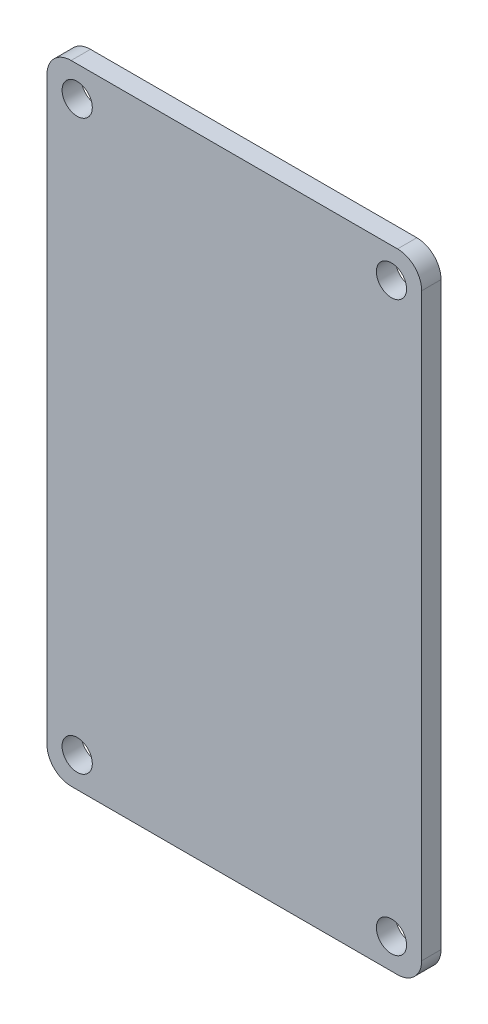
ISO-10303-21;
HEADER;
FILE_DESCRIPTION(('STEP AP214'),'2;1');
FILE_NAME('part.step','',(''),(''),'','','');
FILE_SCHEMA(('AUTOMOTIVE_DESIGN { 1 0 10303 214 1 1 1 1 }'));
ENDSEC;
DATA;
#1=APPLICATION_CONTEXT('core data for automotive mechanical design processes');
#2=APPLICATION_PROTOCOL_DEFINITION('international standard','automotive_design',2000,#1);
#3=PRODUCT_CONTEXT('',#1,'mechanical');
#4=PRODUCT('Part','Part','',(#3));
#5=PRODUCT_RELATED_PRODUCT_CATEGORY('part','',(#4));
#6=PRODUCT_DEFINITION_FORMATION('','',#4);
#7=PRODUCT_DEFINITION_CONTEXT('part definition',#1,'design');
#8=PRODUCT_DEFINITION('design','',#6,#7);
#9=PRODUCT_DEFINITION_SHAPE('','',#8);
#10=(LENGTH_UNIT() NAMED_UNIT(*) SI_UNIT(.MILLI.,.METRE.));
#11=(NAMED_UNIT(*) PLANE_ANGLE_UNIT() SI_UNIT($,.RADIAN.));
#12=(NAMED_UNIT(*) SI_UNIT($,.STERADIAN.) SOLID_ANGLE_UNIT());
#13=UNCERTAINTY_MEASURE_WITH_UNIT(LENGTH_MEASURE(1.E-05),#10,'distance_accuracy_value','');
#14=(GEOMETRIC_REPRESENTATION_CONTEXT(3) GLOBAL_UNCERTAINTY_ASSIGNED_CONTEXT((#13)) GLOBAL_UNIT_ASSIGNED_CONTEXT((#10,
#11,#12)) REPRESENTATION_CONTEXT('',''));
#15=CARTESIAN_POINT('',(0.,0.,0.));
#16=DIRECTION('',(0.,0.,1.));
#17=DIRECTION('',(1.,0.,0.));
#18=AXIS2_PLACEMENT_3D('',#15,#16,#17);
#19=CARTESIAN_POINT('',(13.5,-24.,1.6));
#20=DIRECTION('',(0.,0.,1.));
#21=DIRECTION('',(1.,0.,0.));
#22=AXIS2_PLACEMENT_3D('',#19,#20,#21);
#23=PLANE('',#22);
#24=CARTESIAN_POINT('',(13.,-23.5,1.6));
#25=DIRECTION('',(0.,0.,1.));
#26=DIRECTION('',(1.,0.,0.));
#27=AXIS2_PLACEMENT_3D('',#24,#25,#26);
#28=CIRCLE('',#27,1.25);
#29=CARTESIAN_POINT('',(14.25,-23.5,1.6));
#30=VERTEX_POINT('',#29);
#31=EDGE_CURVE('E231',#30,#30,#28,.T.);
#32=ORIENTED_EDGE('',*,*,#31,.F.);
#33=EDGE_LOOP('',(#32));
#34=FACE_BOUND('',#33,.T.);
#35=CARTESIAN_POINT('',(-13.,23.5,1.6));
#36=DIRECTION('',(0.,0.,1.));
#37=DIRECTION('',(1.,0.,0.));
#38=AXIS2_PLACEMENT_3D('',#35,#36,#37);
#39=CIRCLE('',#38,1.25);
#40=CARTESIAN_POINT('',(-11.75,23.5,1.6));
#41=VERTEX_POINT('',#40);
#42=EDGE_CURVE('E158',#41,#41,#39,.T.);
#43=ORIENTED_EDGE('',*,*,#42,.F.);
#44=EDGE_LOOP('',(#43));
#45=FACE_BOUND('',#44,.T.);
#46=CARTESIAN_POINT('',(13.5,-24.,1.6));
#47=DIRECTION('',(0.,0.,1.));
#48=DIRECTION('',(1.,0.,0.));
#49=AXIS2_PLACEMENT_3D('',#46,#47,#48);
#50=CIRCLE('',#49,2.);
#51=CARTESIAN_POINT('',(13.5,-26.,1.6));
#52=VERTEX_POINT('',#51);
#53=CARTESIAN_POINT('',(15.5,-24.,1.6));
#54=VERTEX_POINT('',#53);
#55=EDGE_CURVE('E176',#52,#54,#50,.T.);
#56=ORIENTED_EDGE('',*,*,#55,.T.);
#57=DIRECTION('',(0.,1.,0.));
#58=VECTOR('',#57,1.);
#59=CARTESIAN_POINT('',(15.5,24.,1.6));
#60=LINE('',#59,#58);
#61=CARTESIAN_POINT('',(15.5,24.,1.6));
#62=VERTEX_POINT('',#61);
#63=EDGE_CURVE('E107',#54,#62,#60,.T.);
#64=ORIENTED_EDGE('',*,*,#63,.T.);
#65=CARTESIAN_POINT('',(13.5,24.,1.6));
#66=DIRECTION('',(0.,0.,1.));
#67=DIRECTION('',(-1.,0.,0.));
#68=AXIS2_PLACEMENT_3D('',#65,#66,#67);
#69=CIRCLE('',#68,2.);
#70=CARTESIAN_POINT('',(13.5,26.,1.6));
#71=VERTEX_POINT('',#70);
#72=EDGE_CURVE('E196',#62,#71,#69,.T.);
#73=ORIENTED_EDGE('',*,*,#72,.T.);
#74=DIRECTION('',(-1.,0.,0.));
#75=VECTOR('',#74,1.);
#76=CARTESIAN_POINT('',(-13.5,26.,1.6));
#77=LINE('',#76,#75);
#78=CARTESIAN_POINT('',(-13.5,26.,1.6));
#79=VERTEX_POINT('',#78);
#80=EDGE_CURVE('E210',#71,#79,#77,.T.);
#81=ORIENTED_EDGE('',*,*,#80,.T.);
#82=CARTESIAN_POINT('',(-13.5,24.,1.6));
#83=DIRECTION('',(0.,0.,1.));
#84=DIRECTION('',(1.,0.,0.));
#85=AXIS2_PLACEMENT_3D('',#82,#83,#84);
#86=CIRCLE('',#85,2.);
#87=CARTESIAN_POINT('',(-15.5,24.,1.6));
#88=VERTEX_POINT('',#87);
#89=EDGE_CURVE('E131',#79,#88,#86,.T.);
#90=ORIENTED_EDGE('',*,*,#89,.T.);
#91=DIRECTION('',(0.,-1.,0.));
#92=VECTOR('',#91,1.);
#93=CARTESIAN_POINT('',(-15.5,24.,1.6));
#94=LINE('',#93,#92);
#95=CARTESIAN_POINT('',(-15.5,-24.,1.6));
#96=VERTEX_POINT('',#95);
#97=EDGE_CURVE('E125',#88,#96,#94,.T.);
#98=ORIENTED_EDGE('',*,*,#97,.T.);
#99=CARTESIAN_POINT('',(-13.5,-24.,1.6));
#100=DIRECTION('',(0.,0.,1.));
#101=DIRECTION('',(1.,0.,0.));
#102=AXIS2_PLACEMENT_3D('',#99,#100,#101);
#103=CIRCLE('',#102,2.);
#104=CARTESIAN_POINT('',(-13.5,-26.,1.6));
#105=VERTEX_POINT('',#104);
#106=EDGE_CURVE('E129',#96,#105,#103,.T.);
#107=ORIENTED_EDGE('',*,*,#106,.T.);
#108=DIRECTION('',(1.,0.,0.));
#109=VECTOR('',#108,1.);
#110=CARTESIAN_POINT('',(-13.5,-26.,1.6));
#111=LINE('',#110,#109);
#112=EDGE_CURVE('E57',#105,#52,#111,.T.);
#113=ORIENTED_EDGE('',*,*,#112,.T.);
#114=EDGE_LOOP('',(#56,#64,#73,#81,#90,#98,#107,#113));
#115=FACE_BOUND('',#114,.T.);
#116=CARTESIAN_POINT('',(13.,23.5,1.6));
#117=DIRECTION('',(0.,0.,1.));
#118=DIRECTION('',(-1.,0.,0.));
#119=AXIS2_PLACEMENT_3D('',#116,#117,#118);
#120=CIRCLE('',#119,1.25);
#121=CARTESIAN_POINT('',(11.75,23.5,1.6));
#122=VERTEX_POINT('',#121);
#123=EDGE_CURVE('E223',#122,#122,#120,.T.);
#124=ORIENTED_EDGE('',*,*,#123,.F.);
#125=EDGE_LOOP('',(#124));
#126=FACE_BOUND('',#125,.T.);
#127=CARTESIAN_POINT('',(-13.,-23.5,1.6));
#128=DIRECTION('',(0.,0.,1.));
#129=DIRECTION('',(-1.,0.,0.));
#130=AXIS2_PLACEMENT_3D('',#127,#128,#129);
#131=CIRCLE('',#130,1.25);
#132=CARTESIAN_POINT('',(-14.25,-23.5,1.6));
#133=VERTEX_POINT('',#132);
#134=EDGE_CURVE('E239',#133,#133,#131,.T.);
#135=ORIENTED_EDGE('',*,*,#134,.F.);
#136=EDGE_LOOP('',(#135));
#137=FACE_BOUND('',#136,.T.);
#138=ADVANCED_FACE('F40',(#34,#45,#115,#126,#137),#23,.T.);
#139=CARTESIAN_POINT('',(13.5,-24.,0.));
#140=DIRECTION('',(0.,0.,1.));
#141=DIRECTION('',(1.,0.,0.));
#142=AXIS2_PLACEMENT_3D('',#139,#140,#141);
#143=PLANE('',#142);
#144=CARTESIAN_POINT('',(13.5,-24.,0.));
#145=DIRECTION('',(0.,0.,1.));
#146=DIRECTION('',(1.,0.,0.));
#147=AXIS2_PLACEMENT_3D('',#144,#145,#146);
#148=CIRCLE('',#147,2.);
#149=CARTESIAN_POINT('',(13.5,-26.,0.));
#150=VERTEX_POINT('',#149);
#151=CARTESIAN_POINT('',(15.5,-24.,0.));
#152=VERTEX_POINT('',#151);
#153=EDGE_CURVE('E154',#150,#152,#148,.T.);
#154=ORIENTED_EDGE('',*,*,#153,.F.);
#155=DIRECTION('',(1.,0.,0.));
#156=VECTOR('',#155,1.);
#157=CARTESIAN_POINT('',(-13.5,-26.,0.));
#158=LINE('',#157,#156);
#159=CARTESIAN_POINT('',(-13.5,-26.,0.));
#160=VERTEX_POINT('',#159);
#161=EDGE_CURVE('E99',#160,#150,#158,.T.);
#162=ORIENTED_EDGE('',*,*,#161,.F.);
#163=CARTESIAN_POINT('',(-13.5,-24.,0.));
#164=DIRECTION('',(0.,0.,1.));
#165=DIRECTION('',(1.,0.,0.));
#166=AXIS2_PLACEMENT_3D('',#163,#164,#165);
#167=CIRCLE('',#166,2.);
#168=CARTESIAN_POINT('',(-15.5,-24.,0.));
#169=VERTEX_POINT('',#168);
#170=EDGE_CURVE('E93',#169,#160,#167,.T.);
#171=ORIENTED_EDGE('',*,*,#170,.F.);
#172=DIRECTION('',(0.,-1.,0.));
#173=VECTOR('',#172,1.);
#174=CARTESIAN_POINT('',(-15.5,24.,0.));
#175=LINE('',#174,#173);
#176=CARTESIAN_POINT('',(-15.5,24.,0.));
#177=VERTEX_POINT('',#176);
#178=EDGE_CURVE('E140',#177,#169,#175,.T.);
#179=ORIENTED_EDGE('',*,*,#178,.F.);
#180=CARTESIAN_POINT('',(-13.5,24.,0.));
#181=DIRECTION('',(0.,0.,1.));
#182=DIRECTION('',(1.,0.,0.));
#183=AXIS2_PLACEMENT_3D('',#180,#181,#182);
#184=CIRCLE('',#183,2.);
#185=CARTESIAN_POINT('',(-13.5,26.,0.));
#186=VERTEX_POINT('',#185);
#187=EDGE_CURVE('E167',#186,#177,#184,.T.);
#188=ORIENTED_EDGE('',*,*,#187,.F.);
#189=DIRECTION('',(-1.,0.,0.));
#190=VECTOR('',#189,1.);
#191=CARTESIAN_POINT('',(-13.5,26.,0.));
#192=LINE('',#191,#190);
#193=CARTESIAN_POINT('',(13.5,26.,0.));
#194=VERTEX_POINT('',#193);
#195=EDGE_CURVE('E164',#194,#186,#192,.T.);
#196=ORIENTED_EDGE('',*,*,#195,.F.);
#197=CARTESIAN_POINT('',(13.5,24.,0.));
#198=DIRECTION('',(0.,0.,1.));
#199=DIRECTION('',(-1.,0.,0.));
#200=AXIS2_PLACEMENT_3D('',#197,#198,#199);
#201=CIRCLE('',#200,2.);
#202=CARTESIAN_POINT('',(15.5,24.,0.));
#203=VERTEX_POINT('',#202);
#204=EDGE_CURVE('E161',#203,#194,#201,.T.);
#205=ORIENTED_EDGE('',*,*,#204,.F.);
#206=DIRECTION('',(0.,1.,0.));
#207=VECTOR('',#206,1.);
#208=CARTESIAN_POINT('',(15.5,24.,0.));
#209=LINE('',#208,#207);
#210=EDGE_CURVE('E157',#152,#203,#209,.T.);
#211=ORIENTED_EDGE('',*,*,#210,.F.);
#212=EDGE_LOOP('',(#154,#162,#171,#179,#188,#196,#205,#211));
#213=FACE_BOUND('',#212,.T.);
#214=CARTESIAN_POINT('',(-13.,23.5,0.));
#215=DIRECTION('',(0.,0.,1.));
#216=DIRECTION('',(1.,0.,0.));
#217=AXIS2_PLACEMENT_3D('',#214,#215,#216);
#218=CIRCLE('',#217,1.25);
#219=CARTESIAN_POINT('',(-11.75,23.5,0.));
#220=VERTEX_POINT('',#219);
#221=EDGE_CURVE('E220',#220,#220,#218,.T.);
#222=ORIENTED_EDGE('',*,*,#221,.T.);
#223=EDGE_LOOP('',(#222));
#224=FACE_BOUND('',#223,.T.);
#225=CARTESIAN_POINT('',(13.,23.5,0.));
#226=DIRECTION('',(0.,0.,1.));
#227=DIRECTION('',(-1.,0.,0.));
#228=AXIS2_PLACEMENT_3D('',#225,#226,#227);
#229=CIRCLE('',#228,1.25);
#230=CARTESIAN_POINT('',(11.75,23.5,0.));
#231=VERTEX_POINT('',#230);
#232=EDGE_CURVE('E227',#231,#231,#229,.T.);
#233=ORIENTED_EDGE('',*,*,#232,.T.);
#234=EDGE_LOOP('',(#233));
#235=FACE_BOUND('',#234,.T.);
#236=CARTESIAN_POINT('',(13.,-23.5,0.));
#237=DIRECTION('',(0.,0.,1.));
#238=DIRECTION('',(1.,0.,0.));
#239=AXIS2_PLACEMENT_3D('',#236,#237,#238);
#240=CIRCLE('',#239,1.25);
#241=CARTESIAN_POINT('',(14.25,-23.5,0.));
#242=VERTEX_POINT('',#241);
#243=EDGE_CURVE('E235',#242,#242,#240,.T.);
#244=ORIENTED_EDGE('',*,*,#243,.T.);
#245=EDGE_LOOP('',(#244));
#246=FACE_BOUND('',#245,.T.);
#247=CARTESIAN_POINT('',(-13.,-23.5,0.));
#248=DIRECTION('',(0.,0.,1.));
#249=DIRECTION('',(-1.,0.,0.));
#250=AXIS2_PLACEMENT_3D('',#247,#248,#249);
#251=CIRCLE('',#250,1.25);
#252=CARTESIAN_POINT('',(-14.25,-23.5,0.));
#253=VERTEX_POINT('',#252);
#254=EDGE_CURVE('E243',#253,#253,#251,.T.);
#255=ORIENTED_EDGE('',*,*,#254,.T.);
#256=EDGE_LOOP('',(#255));
#257=FACE_BOUND('',#256,.T.);
#258=ADVANCED_FACE('F200',(#213,#224,#235,#246,#257),#143,.F.);
#259=CARTESIAN_POINT('',(13.5,-24.,1.6));
#260=DIRECTION('',(0.,0.,-1.));
#261=DIRECTION('',(-1.,0.,0.));
#262=AXIS2_PLACEMENT_3D('',#259,#260,#261);
#263=CYLINDRICAL_SURFACE('',#262,2.);
#264=ORIENTED_EDGE('',*,*,#153,.T.);
#265=DIRECTION('',(0.,0.,-1.));
#266=VECTOR('',#265,1.);
#267=CARTESIAN_POINT('',(15.5,-24.,1.6));
#268=LINE('',#267,#266);
#269=EDGE_CURVE('E11',#54,#152,#268,.T.);
#270=ORIENTED_EDGE('',*,*,#269,.F.);
#271=ORIENTED_EDGE('',*,*,#55,.F.);
#272=DIRECTION('',(0.,0.,-1.));
#273=VECTOR('',#272,1.);
#274=CARTESIAN_POINT('',(13.5,-26.,1.6));
#275=LINE('',#274,#273);
#276=EDGE_CURVE('E150',#52,#150,#275,.T.);
#277=ORIENTED_EDGE('',*,*,#276,.T.);
#278=EDGE_LOOP('',(#264,#270,#271,#277));
#279=FACE_BOUND('',#278,.T.);
#280=ADVANCED_FACE('F42',(#279),#263,.T.);
#281=CARTESIAN_POINT('',(15.5,24.,1.6));
#282=DIRECTION('',(-1.,0.,0.));
#283=DIRECTION('',(0.,0.,1.));
#284=AXIS2_PLACEMENT_3D('',#281,#282,#283);
#285=PLANE('',#284);
#286=ORIENTED_EDGE('',*,*,#210,.T.);
#287=DIRECTION('',(0.,0.,-1.));
#288=VECTOR('',#287,1.);
#289=CARTESIAN_POINT('',(15.5,24.,1.6));
#290=LINE('',#289,#288);
#291=EDGE_CURVE('E49',#62,#203,#290,.T.);
#292=ORIENTED_EDGE('',*,*,#291,.F.);
#293=ORIENTED_EDGE('',*,*,#63,.F.);
#294=ORIENTED_EDGE('',*,*,#269,.T.);
#295=EDGE_LOOP('',(#286,#292,#293,#294));
#296=FACE_BOUND('',#295,.T.);
#297=ADVANCED_FACE('F278',(#296),#285,.F.);
#298=CARTESIAN_POINT('',(13.5,24.,1.6));
#299=DIRECTION('',(0.,0.,-1.));
#300=DIRECTION('',(-1.,0.,0.));
#301=AXIS2_PLACEMENT_3D('',#298,#299,#300);
#302=CYLINDRICAL_SURFACE('',#301,2.);
#303=ORIENTED_EDGE('',*,*,#204,.T.);
#304=DIRECTION('',(0.,0.,-1.));
#305=VECTOR('',#304,1.);
#306=CARTESIAN_POINT('',(13.5,26.,1.6));
#307=LINE('',#306,#305);
#308=EDGE_CURVE('E186',#71,#194,#307,.T.);
#309=ORIENTED_EDGE('',*,*,#308,.F.);
#310=ORIENTED_EDGE('',*,*,#72,.F.);
#311=ORIENTED_EDGE('',*,*,#291,.T.);
#312=EDGE_LOOP('',(#303,#309,#310,#311));
#313=FACE_BOUND('',#312,.T.);
#314=ADVANCED_FACE('F194',(#313),#302,.T.);
#315=CARTESIAN_POINT('',(-13.5,26.,1.6));
#316=DIRECTION('',(0.,-1.,0.));
#317=DIRECTION('',(1.,0.,0.));
#318=AXIS2_PLACEMENT_3D('',#315,#316,#317);
#319=PLANE('',#318);
#320=ORIENTED_EDGE('',*,*,#195,.T.);
#321=DIRECTION('',(0.,0.,-1.));
#322=VECTOR('',#321,1.);
#323=CARTESIAN_POINT('',(-13.5,26.,1.6));
#324=LINE('',#323,#322);
#325=EDGE_CURVE('E182',#79,#186,#324,.T.);
#326=ORIENTED_EDGE('',*,*,#325,.F.);
#327=ORIENTED_EDGE('',*,*,#80,.F.);
#328=ORIENTED_EDGE('',*,*,#308,.T.);
#329=EDGE_LOOP('',(#320,#326,#327,#328));
#330=FACE_BOUND('',#329,.T.);
#331=ADVANCED_FACE('F205',(#330),#319,.F.);
#332=CARTESIAN_POINT('',(-13.5,24.,1.6));
#333=DIRECTION('',(0.,0.,-1.));
#334=DIRECTION('',(-1.,0.,0.));
#335=AXIS2_PLACEMENT_3D('',#332,#333,#334);
#336=CYLINDRICAL_SURFACE('',#335,2.);
#337=ORIENTED_EDGE('',*,*,#187,.T.);
#338=DIRECTION('',(0.,0.,-1.));
#339=VECTOR('',#338,1.);
#340=CARTESIAN_POINT('',(-15.5,24.,1.6));
#341=LINE('',#340,#339);
#342=EDGE_CURVE('E142',#88,#177,#341,.T.);
#343=ORIENTED_EDGE('',*,*,#342,.F.);
#344=ORIENTED_EDGE('',*,*,#89,.F.);
#345=ORIENTED_EDGE('',*,*,#325,.T.);
#346=EDGE_LOOP('',(#337,#343,#344,#345));
#347=FACE_BOUND('',#346,.T.);
#348=ADVANCED_FACE('F208',(#347),#336,.T.);
#349=CARTESIAN_POINT('',(-15.5,24.,1.6));
#350=DIRECTION('',(1.,0.,0.));
#351=DIRECTION('',(0.,1.,0.));
#352=AXIS2_PLACEMENT_3D('',#349,#350,#351);
#353=PLANE('',#352);
#354=ORIENTED_EDGE('',*,*,#178,.T.);
#355=DIRECTION('',(0.,0.,-1.));
#356=VECTOR('',#355,1.);
#357=CARTESIAN_POINT('',(-15.5,-24.,1.6));
#358=LINE('',#357,#356);
#359=EDGE_CURVE('E137',#96,#169,#358,.T.);
#360=ORIENTED_EDGE('',*,*,#359,.F.);
#361=ORIENTED_EDGE('',*,*,#97,.F.);
#362=ORIENTED_EDGE('',*,*,#342,.T.);
#363=EDGE_LOOP('',(#354,#360,#361,#362));
#364=FACE_BOUND('',#363,.T.);
#365=ADVANCED_FACE('F138',(#364),#353,.F.);
#366=CARTESIAN_POINT('',(-13.5,-24.,1.6));
#367=DIRECTION('',(0.,0.,-1.));
#368=DIRECTION('',(-1.,0.,0.));
#369=AXIS2_PLACEMENT_3D('',#366,#367,#368);
#370=CYLINDRICAL_SURFACE('',#369,2.);
#371=ORIENTED_EDGE('',*,*,#170,.T.);
#372=DIRECTION('',(0.,0.,-1.));
#373=VECTOR('',#372,1.);
#374=CARTESIAN_POINT('',(-13.5,-26.,1.6));
#375=LINE('',#374,#373);
#376=EDGE_CURVE('E143',#105,#160,#375,.T.);
#377=ORIENTED_EDGE('',*,*,#376,.F.);
#378=ORIENTED_EDGE('',*,*,#106,.F.);
#379=ORIENTED_EDGE('',*,*,#359,.T.);
#380=EDGE_LOOP('',(#371,#377,#378,#379));
#381=FACE_BOUND('',#380,.T.);
#382=ADVANCED_FACE('F145',(#381),#370,.T.);
#383=CARTESIAN_POINT('',(-13.5,-26.,1.6));
#384=DIRECTION('',(0.,1.,0.));
#385=DIRECTION('',(-1.,0.,0.));
#386=AXIS2_PLACEMENT_3D('',#383,#384,#385);
#387=PLANE('',#386);
#388=ORIENTED_EDGE('',*,*,#161,.T.);
#389=ORIENTED_EDGE('',*,*,#276,.F.);
#390=ORIENTED_EDGE('',*,*,#112,.F.);
#391=ORIENTED_EDGE('',*,*,#376,.T.);
#392=EDGE_LOOP('',(#388,#389,#390,#391));
#393=FACE_BOUND('',#392,.T.);
#394=ADVANCED_FACE('F266',(#393),#387,.F.);
#395=CARTESIAN_POINT('',(-13.,23.5,1.6));
#396=DIRECTION('',(0.,0.,-1.));
#397=DIRECTION('',(-1.,0.,0.));
#398=AXIS2_PLACEMENT_3D('',#395,#396,#397);
#399=CYLINDRICAL_SURFACE('',#398,1.25);
#400=ORIENTED_EDGE('',*,*,#42,.T.);
#401=EDGE_LOOP('',(#400));
#402=FACE_BOUND('',#401,.T.);
#403=ORIENTED_EDGE('',*,*,#221,.F.);
#404=EDGE_LOOP('',(#403));
#405=FACE_BOUND('',#404,.T.);
#406=ADVANCED_FACE('F263',(#402,#405),#399,.F.);
#407=CARTESIAN_POINT('',(13.,23.5,1.6));
#408=DIRECTION('',(0.,0.,-1.));
#409=DIRECTION('',(-1.,0.,0.));
#410=AXIS2_PLACEMENT_3D('',#407,#408,#409);
#411=CYLINDRICAL_SURFACE('',#410,1.25);
#412=ORIENTED_EDGE('',*,*,#123,.T.);
#413=EDGE_LOOP('',(#412));
#414=FACE_BOUND('',#413,.T.);
#415=ORIENTED_EDGE('',*,*,#232,.F.);
#416=EDGE_LOOP('',(#415));
#417=FACE_BOUND('',#416,.T.);
#418=ADVANCED_FACE('F344',(#414,#417),#411,.F.);
#419=CARTESIAN_POINT('',(13.,-23.5,1.6));
#420=DIRECTION('',(0.,0.,-1.));
#421=DIRECTION('',(-1.,0.,0.));
#422=AXIS2_PLACEMENT_3D('',#419,#420,#421);
#423=CYLINDRICAL_SURFACE('',#422,1.25);
#424=ORIENTED_EDGE('',*,*,#31,.T.);
#425=EDGE_LOOP('',(#424));
#426=FACE_BOUND('',#425,.T.);
#427=ORIENTED_EDGE('',*,*,#243,.F.);
#428=EDGE_LOOP('',(#427));
#429=FACE_BOUND('',#428,.T.);
#430=ADVANCED_FACE('F352',(#426,#429),#423,.F.);
#431=CARTESIAN_POINT('',(-13.,-23.5,1.6));
#432=DIRECTION('',(0.,0.,-1.));
#433=DIRECTION('',(-1.,0.,0.));
#434=AXIS2_PLACEMENT_3D('',#431,#432,#433);
#435=CYLINDRICAL_SURFACE('',#434,1.25);
#436=ORIENTED_EDGE('',*,*,#134,.T.);
#437=EDGE_LOOP('',(#436));
#438=FACE_BOUND('',#437,.T.);
#439=ORIENTED_EDGE('',*,*,#254,.F.);
#440=EDGE_LOOP('',(#439));
#441=FACE_BOUND('',#440,.T.);
#442=ADVANCED_FACE('F250',(#438,#441),#435,.F.);
#443=CLOSED_SHELL('',(#138,#258,#280,#297,#314,#331,#348,#365,#382,#394,#406,#418,#430,#442));
#444=MANIFOLD_SOLID_BREP('B2',#443);
#445=ADVANCED_BREP_SHAPE_REPRESENTATION('',(#18,#444),#14);
#446=SHAPE_DEFINITION_REPRESENTATION(#9,#445);
ENDSEC;
END-ISO-10303-21;
